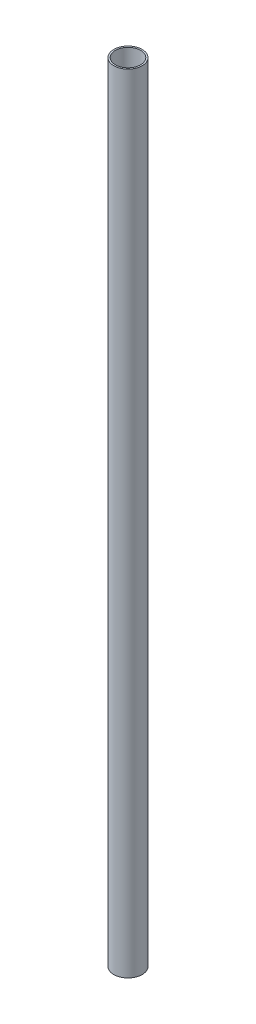
ISO-10303-21;
HEADER;
FILE_DESCRIPTION(('STEP AP214'),'2;1');
FILE_NAME('part.step','',(''),(''),'','','');
FILE_SCHEMA(('AUTOMOTIVE_DESIGN { 1 0 10303 214 1 1 1 1 }'));
ENDSEC;
DATA;
#1=APPLICATION_CONTEXT('core data for automotive mechanical design processes');
#2=APPLICATION_PROTOCOL_DEFINITION('international standard','automotive_design',2000,#1);
#3=PRODUCT_CONTEXT('',#1,'mechanical');
#4=PRODUCT('Part','Part','',(#3));
#5=PRODUCT_RELATED_PRODUCT_CATEGORY('part','',(#4));
#6=PRODUCT_DEFINITION_FORMATION('','',#4);
#7=PRODUCT_DEFINITION_CONTEXT('part definition',#1,'design');
#8=PRODUCT_DEFINITION('design','',#6,#7);
#9=PRODUCT_DEFINITION_SHAPE('','',#8);
#10=(LENGTH_UNIT() NAMED_UNIT(*) SI_UNIT(.MILLI.,.METRE.));
#11=(NAMED_UNIT(*) PLANE_ANGLE_UNIT() SI_UNIT($,.RADIAN.));
#12=(NAMED_UNIT(*) SI_UNIT($,.STERADIAN.) SOLID_ANGLE_UNIT());
#13=UNCERTAINTY_MEASURE_WITH_UNIT(LENGTH_MEASURE(1.E-05),#10,'distance_accuracy_value','');
#14=(GEOMETRIC_REPRESENTATION_CONTEXT(3) GLOBAL_UNCERTAINTY_ASSIGNED_CONTEXT((#13)) GLOBAL_UNIT_ASSIGNED_CONTEXT((#10,
#11,#12)) REPRESENTATION_CONTEXT('',''));
#15=CARTESIAN_POINT('',(0.,0.,0.));
#16=DIRECTION('',(0.,0.,1.));
#17=DIRECTION('',(1.,0.,0.));
#18=AXIS2_PLACEMENT_3D('',#15,#16,#17);
#19=CARTESIAN_POINT('',(0.,0.,0.));
#20=DIRECTION('',(0.,1.,0.));
#21=DIRECTION('',(0.,0.,1.));
#22=AXIS2_PLACEMENT_3D('',#19,#20,#21);
#23=CYLINDRICAL_SURFACE('',#22,8.);
#24=CARTESIAN_POINT('',(0.,0.,0.));
#25=DIRECTION('',(0.,1.,0.));
#26=DIRECTION('',(0.,0.,1.));
#27=AXIS2_PLACEMENT_3D('',#24,#25,#26);
#28=CIRCLE('',#27,8.);
#29=CARTESIAN_POINT('',(0.,0.,8.));
#30=VERTEX_POINT('',#29);
#31=EDGE_CURVE('E27',#30,#30,#28,.F.);
#32=ORIENTED_EDGE('',*,*,#31,.T.);
#33=EDGE_LOOP('',(#32));
#34=FACE_BOUND('',#33,.T.);
#35=CARTESIAN_POINT('',(0.,500.,0.));
#36=DIRECTION('',(0.,1.,0.));
#37=DIRECTION('',(0.,0.,1.));
#38=AXIS2_PLACEMENT_3D('',#35,#36,#37);
#39=CIRCLE('',#38,8.);
#40=CARTESIAN_POINT('',(0.,500.,8.));
#41=VERTEX_POINT('',#40);
#42=EDGE_CURVE('E18',#41,#41,#39,.F.);
#43=ORIENTED_EDGE('',*,*,#42,.F.);
#44=EDGE_LOOP('',(#43));
#45=FACE_BOUND('',#44,.T.);
#46=ADVANCED_FACE('F15',(#34,#45),#23,.F.);
#47=CARTESIAN_POINT('',(0.,500.,0.));
#48=DIRECTION('',(0.,1.,0.));
#49=DIRECTION('',(0.,0.,1.));
#50=AXIS2_PLACEMENT_3D('',#47,#48,#49);
#51=PLANE('',#50);
#52=ORIENTED_EDGE('',*,*,#42,.T.);
#53=EDGE_LOOP('',(#52));
#54=FACE_BOUND('',#53,.T.);
#55=CARTESIAN_POINT('',(0.,500.,0.));
#56=DIRECTION('',(0.,1.,0.));
#57=DIRECTION('',(0.,0.,1.));
#58=AXIS2_PLACEMENT_3D('',#55,#56,#57);
#59=CIRCLE('',#58,9.);
#60=CARTESIAN_POINT('',(0.,500.,9.));
#61=VERTEX_POINT('',#60);
#62=EDGE_CURVE('E22',#61,#61,#59,.F.);
#63=ORIENTED_EDGE('',*,*,#62,.F.);
#64=EDGE_LOOP('',(#63));
#65=FACE_BOUND('',#64,.T.);
#66=ADVANCED_FACE('F35',(#54,#65),#51,.T.);
#67=CARTESIAN_POINT('',(0.,0.,0.));
#68=DIRECTION('',(0.,1.,0.));
#69=DIRECTION('',(0.,0.,1.));
#70=AXIS2_PLACEMENT_3D('',#67,#68,#69);
#71=PLANE('',#70);
#72=ORIENTED_EDGE('',*,*,#31,.F.);
#73=EDGE_LOOP('',(#72));
#74=FACE_BOUND('',#73,.T.);
#75=CARTESIAN_POINT('',(0.,0.,0.));
#76=DIRECTION('',(0.,1.,0.));
#77=DIRECTION('',(0.,0.,1.));
#78=AXIS2_PLACEMENT_3D('',#75,#76,#77);
#79=CIRCLE('',#78,9.);
#80=CARTESIAN_POINT('',(0.,0.,9.));
#81=VERTEX_POINT('',#80);
#82=EDGE_CURVE('E10',#81,#81,#79,.T.);
#83=ORIENTED_EDGE('',*,*,#82,.F.);
#84=EDGE_LOOP('',(#83));
#85=FACE_BOUND('',#84,.T.);
#86=ADVANCED_FACE('F43',(#74,#85),#71,.F.);
#87=CARTESIAN_POINT('',(0.,0.,0.));
#88=DIRECTION('',(0.,1.,0.));
#89=DIRECTION('',(0.,0.,1.));
#90=AXIS2_PLACEMENT_3D('',#87,#88,#89);
#91=CYLINDRICAL_SURFACE('',#90,9.);
#92=ORIENTED_EDGE('',*,*,#82,.T.);
#93=EDGE_LOOP('',(#92));
#94=FACE_BOUND('',#93,.T.);
#95=ORIENTED_EDGE('',*,*,#62,.T.);
#96=EDGE_LOOP('',(#95));
#97=FACE_BOUND('',#96,.T.);
#98=ADVANCED_FACE('F44',(#94,#97),#91,.T.);
#99=CLOSED_SHELL('',(#46,#66,#86,#98));
#100=MANIFOLD_SOLID_BREP('B1',#99);
#101=ADVANCED_BREP_SHAPE_REPRESENTATION('',(#18,#100),#14);
#102=SHAPE_DEFINITION_REPRESENTATION(#9,#101);
ENDSEC;
END-ISO-10303-21;
